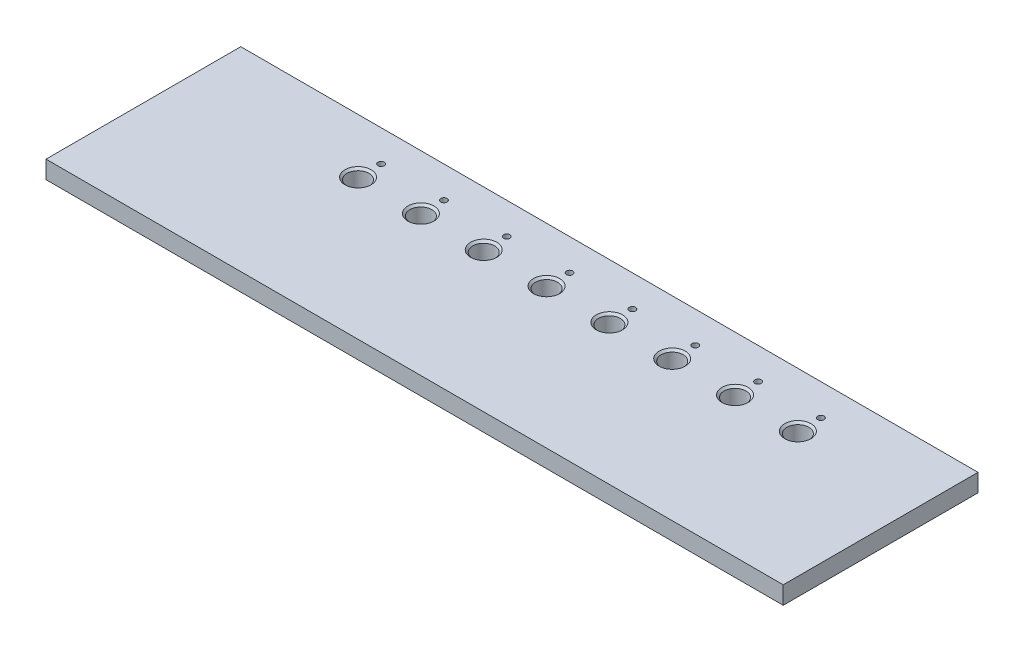
ISO-10303-21;
HEADER;
FILE_DESCRIPTION(('STEP AP214'),'2;1');
FILE_NAME('part.step','',(''),(''),'','','');
FILE_SCHEMA(('AUTOMOTIVE_DESIGN { 1 0 10303 214 1 1 1 1 }'));
ENDSEC;
DATA;
#1=APPLICATION_CONTEXT('core data for automotive mechanical design processes');
#2=APPLICATION_PROTOCOL_DEFINITION('international standard','automotive_design',2000,#1);
#3=PRODUCT_CONTEXT('',#1,'mechanical');
#4=PRODUCT('Part','Part','',(#3));
#5=PRODUCT_RELATED_PRODUCT_CATEGORY('part','',(#4));
#6=PRODUCT_DEFINITION_FORMATION('','',#4);
#7=PRODUCT_DEFINITION_CONTEXT('part definition',#1,'design');
#8=PRODUCT_DEFINITION('design','',#6,#7);
#9=PRODUCT_DEFINITION_SHAPE('','',#8);
#10=(LENGTH_UNIT() NAMED_UNIT(*) SI_UNIT(.MILLI.,.METRE.));
#11=(NAMED_UNIT(*) PLANE_ANGLE_UNIT() SI_UNIT($,.RADIAN.));
#12=(NAMED_UNIT(*) SI_UNIT($,.STERADIAN.) SOLID_ANGLE_UNIT());
#13=UNCERTAINTY_MEASURE_WITH_UNIT(LENGTH_MEASURE(1.E-05),#10,'distance_accuracy_value','');
#14=(GEOMETRIC_REPRESENTATION_CONTEXT(3) GLOBAL_UNCERTAINTY_ASSIGNED_CONTEXT((#13)) GLOBAL_UNIT_ASSIGNED_CONTEXT((#10,
#11,#12)) REPRESENTATION_CONTEXT('',''));
#15=CARTESIAN_POINT('',(0.,0.,0.));
#16=DIRECTION('',(0.,0.,1.));
#17=DIRECTION('',(1.,0.,0.));
#18=AXIS2_PLACEMENT_3D('',#15,#16,#17);
#19=CARTESIAN_POINT('',(181.,-8.5,0.));
#20=DIRECTION('',(1.,0.,0.));
#21=DIRECTION('',(0.,0.,-1.));
#22=AXIS2_PLACEMENT_3D('',#19,#20,#21);
#23=PLANE('',#22);
#24=DIRECTION('',(0.,0.,-1.));
#25=VECTOR('',#24,1.);
#26=CARTESIAN_POINT('',(181.,0.,0.));
#27=LINE('',#26,#25);
#28=CARTESIAN_POINT('',(181.,0.,93.));
#29=VERTEX_POINT('',#28);
#30=CARTESIAN_POINT('',(181.,0.,0.));
#31=VERTEX_POINT('',#30);
#32=EDGE_CURVE('E112',#29,#31,#27,.T.);
#33=ORIENTED_EDGE('',*,*,#32,.F.);
#34=DIRECTION('',(0.,1.,0.));
#35=VECTOR('',#34,1.);
#36=CARTESIAN_POINT('',(181.,-8.5,93.));
#37=LINE('',#36,#35);
#38=CARTESIAN_POINT('',(181.,-8.5,93.));
#39=VERTEX_POINT('',#38);
#40=EDGE_CURVE('E60',#39,#29,#37,.T.);
#41=ORIENTED_EDGE('',*,*,#40,.F.);
#42=DIRECTION('',(0.,0.,-1.));
#43=VECTOR('',#42,1.);
#44=CARTESIAN_POINT('',(181.,-8.5,0.));
#45=LINE('',#44,#43);
#46=CARTESIAN_POINT('',(181.,-8.5,0.));
#47=VERTEX_POINT('',#46);
#48=EDGE_CURVE('E105',#39,#47,#45,.T.);
#49=ORIENTED_EDGE('',*,*,#48,.T.);
#50=DIRECTION('',(0.,1.,0.));
#51=VECTOR('',#50,1.);
#52=CARTESIAN_POINT('',(181.,-8.5,0.));
#53=LINE('',#52,#51);
#54=EDGE_CURVE('E88',#47,#31,#53,.T.);
#55=ORIENTED_EDGE('',*,*,#54,.T.);
#56=EDGE_LOOP('',(#33,#41,#49,#55));
#57=FACE_BOUND('',#56,.T.);
#58=ADVANCED_FACE('F42',(#57),#23,.T.);
#59=CARTESIAN_POINT('',(181.,-8.5,93.));
#60=DIRECTION('',(0.,0.,1.));
#61=DIRECTION('',(1.,0.,0.));
#62=AXIS2_PLACEMENT_3D('',#59,#60,#61);
#63=PLANE('',#62);
#64=DIRECTION('',(1.,0.,0.));
#65=VECTOR('',#64,1.);
#66=CARTESIAN_POINT('',(181.,0.,93.));
#67=LINE('',#66,#65);
#68=CARTESIAN_POINT('',(-171.,0.,93.));
#69=VERTEX_POINT('',#68);
#70=EDGE_CURVE('E107',#69,#29,#67,.T.);
#71=ORIENTED_EDGE('',*,*,#70,.F.);
#72=DIRECTION('',(0.,1.,0.));
#73=VECTOR('',#72,1.);
#74=CARTESIAN_POINT('',(-171.,-8.5,93.));
#75=LINE('',#74,#73);
#76=CARTESIAN_POINT('',(-171.,-8.5,93.));
#77=VERTEX_POINT('',#76);
#78=EDGE_CURVE('E77',#77,#69,#75,.T.);
#79=ORIENTED_EDGE('',*,*,#78,.F.);
#80=DIRECTION('',(1.,0.,0.));
#81=VECTOR('',#80,1.);
#82=CARTESIAN_POINT('',(181.,-8.5,93.));
#83=LINE('',#82,#81);
#84=EDGE_CURVE('E102',#77,#39,#83,.T.);
#85=ORIENTED_EDGE('',*,*,#84,.T.);
#86=ORIENTED_EDGE('',*,*,#40,.T.);
#87=EDGE_LOOP('',(#71,#79,#85,#86));
#88=FACE_BOUND('',#87,.T.);
#89=ADVANCED_FACE('F186',(#88),#63,.T.);
#90=CARTESIAN_POINT('',(-171.,-8.5,0.));
#91=DIRECTION('',(-1.,0.,0.));
#92=DIRECTION('',(0.,0.,1.));
#93=AXIS2_PLACEMENT_3D('',#90,#91,#92);
#94=PLANE('',#93);
#95=DIRECTION('',(0.,0.,1.));
#96=VECTOR('',#95,1.);
#97=CARTESIAN_POINT('',(-171.,0.,0.));
#98=LINE('',#97,#96);
#99=CARTESIAN_POINT('',(-171.,0.,0.));
#100=VERTEX_POINT('',#99);
#101=EDGE_CURVE('E96',#100,#69,#98,.T.);
#102=ORIENTED_EDGE('',*,*,#101,.F.);
#103=DIRECTION('',(0.,1.,0.));
#104=VECTOR('',#103,1.);
#105=CARTESIAN_POINT('',(-171.,-8.5,0.));
#106=LINE('',#105,#104);
#107=CARTESIAN_POINT('',(-171.,-8.5,0.));
#108=VERTEX_POINT('',#107);
#109=EDGE_CURVE('E91',#108,#100,#106,.T.);
#110=ORIENTED_EDGE('',*,*,#109,.F.);
#111=DIRECTION('',(0.,0.,1.));
#112=VECTOR('',#111,1.);
#113=CARTESIAN_POINT('',(-171.,-8.5,0.));
#114=LINE('',#113,#112);
#115=EDGE_CURVE('E94',#108,#77,#114,.T.);
#116=ORIENTED_EDGE('',*,*,#115,.T.);
#117=ORIENTED_EDGE('',*,*,#78,.T.);
#118=EDGE_LOOP('',(#102,#110,#116,#117));
#119=FACE_BOUND('',#118,.T.);
#120=ADVANCED_FACE('F93',(#119),#94,.T.);
#121=CARTESIAN_POINT('',(181.,-8.5,0.));
#122=DIRECTION('',(0.,0.,-1.));
#123=DIRECTION('',(-1.,0.,0.));
#124=AXIS2_PLACEMENT_3D('',#121,#122,#123);
#125=PLANE('',#124);
#126=DIRECTION('',(-1.,0.,0.));
#127=VECTOR('',#126,1.);
#128=CARTESIAN_POINT('',(181.,0.,0.));
#129=LINE('',#128,#127);
#130=EDGE_CURVE('E115',#31,#100,#129,.T.);
#131=ORIENTED_EDGE('',*,*,#130,.F.);
#132=ORIENTED_EDGE('',*,*,#54,.F.);
#133=DIRECTION('',(-1.,0.,0.));
#134=VECTOR('',#133,1.);
#135=CARTESIAN_POINT('',(181.,-8.5,0.));
#136=LINE('',#135,#134);
#137=EDGE_CURVE('E101',#47,#108,#136,.T.);
#138=ORIENTED_EDGE('',*,*,#137,.T.);
#139=ORIENTED_EDGE('',*,*,#109,.T.);
#140=EDGE_LOOP('',(#131,#132,#138,#139));
#141=FACE_BOUND('',#140,.T.);
#142=ADVANCED_FACE('F104',(#141),#125,.T.);
#143=CARTESIAN_POINT('',(0.,-8.5,0.));
#144=DIRECTION('',(0.,-1.,0.));
#145=DIRECTION('',(0.,0.,-1.));
#146=AXIS2_PLACEMENT_3D('',#143,#144,#145);
#147=PLANE('',#146);
#148=CARTESIAN_POINT('',(-29.,-8.5,26.));
#149=DIRECTION('',(0.,1.,0.));
#150=DIRECTION('',(0.,0.,1.));
#151=AXIS2_PLACEMENT_3D('',#148,#149,#150);
#152=CIRCLE('',#151,5.24999999999994);
#153=CARTESIAN_POINT('',(-29.,-8.5,31.2499999999999));
#154=VERTEX_POINT('',#153);
#155=EDGE_CURVE('E268',#154,#154,#152,.T.);
#156=ORIENTED_EDGE('',*,*,#155,.T.);
#157=EDGE_LOOP('',(#156));
#158=FACE_BOUND('',#157,.T.);
#159=CARTESIAN_POINT('',(0.999999999999973,-8.5,15.));
#160=DIRECTION('',(0.,1.,0.));
#161=DIRECTION('',(0.,0.,1.));
#162=AXIS2_PLACEMENT_3D('',#159,#160,#161);
#163=CIRCLE('',#162,1.50000000000008);
#164=CARTESIAN_POINT('',(0.999999999999973,-8.5,16.5000000000001));
#165=VERTEX_POINT('',#164);
#166=EDGE_CURVE('E256',#165,#165,#163,.T.);
#167=ORIENTED_EDGE('',*,*,#166,.T.);
#168=EDGE_LOOP('',(#167));
#169=FACE_BOUND('',#168,.T.);
#170=CARTESIAN_POINT('',(0.999999999999973,-8.5,26.));
#171=DIRECTION('',(0.,1.,0.));
#172=DIRECTION('',(0.,0.,1.));
#173=AXIS2_PLACEMENT_3D('',#170,#171,#172);
#174=CIRCLE('',#173,5.24999999999993);
#175=CARTESIAN_POINT('',(0.999999999999973,-8.5,31.2499999999999));
#176=VERTEX_POINT('',#175);
#177=EDGE_CURVE('E250',#176,#176,#174,.T.);
#178=ORIENTED_EDGE('',*,*,#177,.T.);
#179=EDGE_LOOP('',(#178));
#180=FACE_BOUND('',#179,.T.);
#181=CARTESIAN_POINT('',(31.,-8.5,15.));
#182=DIRECTION('',(0.,1.,0.));
#183=DIRECTION('',(0.,0.,1.));
#184=AXIS2_PLACEMENT_3D('',#181,#182,#183);
#185=CIRCLE('',#184,1.50000000000008);
#186=CARTESIAN_POINT('',(31.,-8.5,16.5000000000001));
#187=VERTEX_POINT('',#186);
#188=EDGE_CURVE('E253',#187,#187,#185,.T.);
#189=ORIENTED_EDGE('',*,*,#188,.T.);
#190=EDGE_LOOP('',(#189));
#191=FACE_BOUND('',#190,.T.);
#192=CARTESIAN_POINT('',(-89.,-8.5,26.));
#193=DIRECTION('',(0.,1.,0.));
#194=DIRECTION('',(0.,0.,1.));
#195=AXIS2_PLACEMENT_3D('',#192,#193,#194);
#196=CIRCLE('',#195,5.24999999999993);
#197=CARTESIAN_POINT('',(-89.,-8.5,31.2499999999999));
#198=VERTEX_POINT('',#197);
#199=EDGE_CURVE('E283',#198,#198,#196,.T.);
#200=ORIENTED_EDGE('',*,*,#199,.T.);
#201=EDGE_LOOP('',(#200));
#202=FACE_BOUND('',#201,.T.);
#203=CARTESIAN_POINT('',(-59.,-8.5,15.));
#204=DIRECTION('',(0.,1.,0.));
#205=DIRECTION('',(0.,0.,1.));
#206=AXIS2_PLACEMENT_3D('',#203,#204,#205);
#207=CIRCLE('',#206,1.50000000000007);
#208=CARTESIAN_POINT('',(-59.,-8.5,16.5000000000001));
#209=VERTEX_POINT('',#208);
#210=EDGE_CURVE('E287',#209,#209,#207,.T.);
#211=ORIENTED_EDGE('',*,*,#210,.T.);
#212=EDGE_LOOP('',(#211));
#213=FACE_BOUND('',#212,.T.);
#214=CARTESIAN_POINT('',(-59.,-8.5,26.));
#215=DIRECTION('',(0.,1.,0.));
#216=DIRECTION('',(0.,0.,1.));
#217=AXIS2_PLACEMENT_3D('',#214,#215,#216);
#218=CIRCLE('',#217,5.24999999999993);
#219=CARTESIAN_POINT('',(-59.,-8.5,31.2499999999999));
#220=VERTEX_POINT('',#219);
#221=EDGE_CURVE('E274',#220,#220,#218,.T.);
#222=ORIENTED_EDGE('',*,*,#221,.T.);
#223=EDGE_LOOP('',(#222));
#224=FACE_BOUND('',#223,.T.);
#225=CARTESIAN_POINT('',(-29.,-8.5,15.));
#226=DIRECTION('',(0.,1.,0.));
#227=DIRECTION('',(0.,0.,1.));
#228=AXIS2_PLACEMENT_3D('',#225,#226,#227);
#229=CIRCLE('',#228,1.50000000000008);
#230=CARTESIAN_POINT('',(-29.,-8.5,16.5000000000001));
#231=VERTEX_POINT('',#230);
#232=EDGE_CURVE('E278',#231,#231,#229,.T.);
#233=ORIENTED_EDGE('',*,*,#232,.T.);
#234=EDGE_LOOP('',(#233));
#235=FACE_BOUND('',#234,.T.);
#236=CARTESIAN_POINT('',(91.,-8.5,26.));
#237=DIRECTION('',(0.,1.,0.));
#238=DIRECTION('',(0.,0.,1.));
#239=AXIS2_PLACEMENT_3D('',#236,#237,#238);
#240=CIRCLE('',#239,5.24999999999993);
#241=CARTESIAN_POINT('',(91.,-8.5,31.2499999999999));
#242=VERTEX_POINT('',#241);
#243=EDGE_CURVE('E540',#242,#242,#240,.T.);
#244=ORIENTED_EDGE('',*,*,#243,.T.);
#245=EDGE_LOOP('',(#244));
#246=FACE_BOUND('',#245,.T.);
#247=CARTESIAN_POINT('',(121.,-8.5,15.));
#248=DIRECTION('',(0.,1.,0.));
#249=DIRECTION('',(0.,0.,1.));
#250=AXIS2_PLACEMENT_3D('',#247,#248,#249);
#251=CIRCLE('',#250,1.50000000000007);
#252=CARTESIAN_POINT('',(121.,-8.5,16.5000000000001));
#253=VERTEX_POINT('',#252);
#254=EDGE_CURVE('E544',#253,#253,#251,.T.);
#255=ORIENTED_EDGE('',*,*,#254,.T.);
#256=EDGE_LOOP('',(#255));
#257=FACE_BOUND('',#256,.T.);
#258=CARTESIAN_POINT('',(121.,-8.5,26.));
#259=DIRECTION('',(0.,1.,0.));
#260=DIRECTION('',(0.,0.,1.));
#261=AXIS2_PLACEMENT_3D('',#258,#259,#260);
#262=CIRCLE('',#261,5.24999999999992);
#263=CARTESIAN_POINT('',(121.,-8.5,31.2499999999999));
#264=VERTEX_POINT('',#263);
#265=EDGE_CURVE('E548',#264,#264,#262,.T.);
#266=ORIENTED_EDGE('',*,*,#265,.T.);
#267=EDGE_LOOP('',(#266));
#268=FACE_BOUND('',#267,.T.);
#269=CARTESIAN_POINT('',(31.,-8.5,26.));
#270=DIRECTION('',(0.,1.,0.));
#271=DIRECTION('',(0.,0.,1.));
#272=AXIS2_PLACEMENT_3D('',#269,#270,#271);
#273=CIRCLE('',#272,5.24999999999994);
#274=CARTESIAN_POINT('',(31.,-8.5,31.2499999999999));
#275=VERTEX_POINT('',#274);
#276=EDGE_CURVE('E267',#275,#275,#273,.T.);
#277=ORIENTED_EDGE('',*,*,#276,.T.);
#278=EDGE_LOOP('',(#277));
#279=FACE_BOUND('',#278,.T.);
#280=CARTESIAN_POINT('',(61.,-8.5,15.));
#281=DIRECTION('',(0.,1.,0.));
#282=DIRECTION('',(0.,0.,1.));
#283=AXIS2_PLACEMENT_3D('',#280,#281,#282);
#284=CIRCLE('',#283,1.50000000000007);
#285=CARTESIAN_POINT('',(61.,-8.5,16.5000000000001));
#286=VERTEX_POINT('',#285);
#287=EDGE_CURVE('E555',#286,#286,#284,.T.);
#288=ORIENTED_EDGE('',*,*,#287,.T.);
#289=EDGE_LOOP('',(#288));
#290=FACE_BOUND('',#289,.T.);
#291=CARTESIAN_POINT('',(61.,-8.5,26.));
#292=DIRECTION('',(0.,1.,0.));
#293=DIRECTION('',(0.,0.,1.));
#294=AXIS2_PLACEMENT_3D('',#291,#292,#293);
#295=CIRCLE('',#294,5.24999999999993);
#296=CARTESIAN_POINT('',(61.,-8.5,31.2499999999999));
#297=VERTEX_POINT('',#296);
#298=EDGE_CURVE('E559',#297,#297,#295,.T.);
#299=ORIENTED_EDGE('',*,*,#298,.T.);
#300=EDGE_LOOP('',(#299));
#301=FACE_BOUND('',#300,.T.);
#302=CARTESIAN_POINT('',(91.,-8.5,15.));
#303=DIRECTION('',(0.,1.,0.));
#304=DIRECTION('',(0.,0.,1.));
#305=AXIS2_PLACEMENT_3D('',#302,#303,#304);
#306=CIRCLE('',#305,1.50000000000007);
#307=CARTESIAN_POINT('',(91.,-8.5,16.5000000000001));
#308=VERTEX_POINT('',#307);
#309=EDGE_CURVE('E563',#308,#308,#306,.T.);
#310=ORIENTED_EDGE('',*,*,#309,.T.);
#311=EDGE_LOOP('',(#310));
#312=FACE_BOUND('',#311,.T.);
#313=CARTESIAN_POINT('',(-89.,-8.5,15.));
#314=DIRECTION('',(0.,1.,0.));
#315=DIRECTION('',(0.,0.,1.));
#316=AXIS2_PLACEMENT_3D('',#313,#314,#315);
#317=CIRCLE('',#316,1.50000000000007);
#318=CARTESIAN_POINT('',(-89.,-8.5,16.5000000000001));
#319=VERTEX_POINT('',#318);
#320=EDGE_CURVE('E116',#319,#319,#317,.T.);
#321=ORIENTED_EDGE('',*,*,#320,.T.);
#322=EDGE_LOOP('',(#321));
#323=FACE_BOUND('',#322,.T.);
#324=ORIENTED_EDGE('',*,*,#48,.F.);
#325=ORIENTED_EDGE('',*,*,#84,.F.);
#326=ORIENTED_EDGE('',*,*,#115,.F.);
#327=ORIENTED_EDGE('',*,*,#137,.F.);
#328=EDGE_LOOP('',(#324,#325,#326,#327));
#329=FACE_BOUND('',#328,.T.);
#330=ADVANCED_FACE('F100',(#158,#169,#180,#191,#202,#213,#224,#235,#246,#257,#268,#279,#290,
#301,#312,#323,#329),#147,.T.);
#331=CARTESIAN_POINT('',(0.,0.,0.));
#332=DIRECTION('',(0.,-1.,0.));
#333=DIRECTION('',(0.,0.,-1.));
#334=AXIS2_PLACEMENT_3D('',#331,#332,#333);
#335=PLANE('',#334);
#336=CARTESIAN_POINT('',(121.,0.,26.));
#337=DIRECTION('',(0.,-1.,0.));
#338=DIRECTION('',(0.,0.,-1.));
#339=AXIS2_PLACEMENT_3D('',#336,#337,#338);
#340=CIRCLE('',#339,6.24999999999992);
#341=CARTESIAN_POINT('',(121.,0.,19.7500000000001));
#342=VERTEX_POINT('',#341);
#343=EDGE_CURVE('E148',#342,#342,#340,.T.);
#344=ORIENTED_EDGE('',*,*,#343,.T.);
#345=EDGE_LOOP('',(#344));
#346=FACE_BOUND('',#345,.T.);
#347=CARTESIAN_POINT('',(91.,0.,26.));
#348=DIRECTION('',(0.,-1.,0.));
#349=DIRECTION('',(0.,0.,-1.));
#350=AXIS2_PLACEMENT_3D('',#347,#348,#349);
#351=CIRCLE('',#350,6.24999999999993);
#352=CARTESIAN_POINT('',(91.,0.,19.7500000000001));
#353=VERTEX_POINT('',#352);
#354=EDGE_CURVE('E145',#353,#353,#351,.T.);
#355=ORIENTED_EDGE('',*,*,#354,.T.);
#356=EDGE_LOOP('',(#355));
#357=FACE_BOUND('',#356,.T.);
#358=CARTESIAN_POINT('',(61.,0.,26.));
#359=DIRECTION('',(0.,-1.,0.));
#360=DIRECTION('',(0.,0.,-1.));
#361=AXIS2_PLACEMENT_3D('',#358,#359,#360);
#362=CIRCLE('',#361,6.24999999999993);
#363=CARTESIAN_POINT('',(61.,0.,19.7500000000001));
#364=VERTEX_POINT('',#363);
#365=EDGE_CURVE('E142',#364,#364,#362,.T.);
#366=ORIENTED_EDGE('',*,*,#365,.T.);
#367=EDGE_LOOP('',(#366));
#368=FACE_BOUND('',#367,.T.);
#369=CARTESIAN_POINT('',(31.,0.,26.));
#370=DIRECTION('',(0.,-1.,0.));
#371=DIRECTION('',(0.,0.,-1.));
#372=AXIS2_PLACEMENT_3D('',#369,#370,#371);
#373=CIRCLE('',#372,6.24999999999992);
#374=CARTESIAN_POINT('',(31.,0.,19.7500000000001));
#375=VERTEX_POINT('',#374);
#376=EDGE_CURVE('E139',#375,#375,#373,.T.);
#377=ORIENTED_EDGE('',*,*,#376,.T.);
#378=EDGE_LOOP('',(#377));
#379=FACE_BOUND('',#378,.T.);
#380=CARTESIAN_POINT('',(0.999999999999973,0.,26.));
#381=DIRECTION('',(0.,-1.,0.));
#382=DIRECTION('',(0.,0.,-1.));
#383=AXIS2_PLACEMENT_3D('',#380,#381,#382);
#384=CIRCLE('',#383,6.24999999999993);
#385=CARTESIAN_POINT('',(0.999999999999973,0.,19.7500000000001));
#386=VERTEX_POINT('',#385);
#387=EDGE_CURVE('E136',#386,#386,#384,.T.);
#388=ORIENTED_EDGE('',*,*,#387,.T.);
#389=EDGE_LOOP('',(#388));
#390=FACE_BOUND('',#389,.T.);
#391=CARTESIAN_POINT('',(-29.,0.,26.));
#392=DIRECTION('',(0.,-1.,0.));
#393=DIRECTION('',(0.,0.,-1.));
#394=AXIS2_PLACEMENT_3D('',#391,#392,#393);
#395=CIRCLE('',#394,6.24999999999993);
#396=CARTESIAN_POINT('',(-29.,0.,19.7500000000001));
#397=VERTEX_POINT('',#396);
#398=EDGE_CURVE('E133',#397,#397,#395,.T.);
#399=ORIENTED_EDGE('',*,*,#398,.T.);
#400=EDGE_LOOP('',(#399));
#401=FACE_BOUND('',#400,.T.);
#402=CARTESIAN_POINT('',(-59.,0.,26.));
#403=DIRECTION('',(0.,-1.,0.));
#404=DIRECTION('',(0.,0.,-1.));
#405=AXIS2_PLACEMENT_3D('',#402,#403,#404);
#406=CIRCLE('',#405,6.24999999999993);
#407=CARTESIAN_POINT('',(-59.,0.,19.7500000000001));
#408=VERTEX_POINT('',#407);
#409=EDGE_CURVE('E130',#408,#408,#406,.T.);
#410=ORIENTED_EDGE('',*,*,#409,.T.);
#411=EDGE_LOOP('',(#410));
#412=FACE_BOUND('',#411,.T.);
#413=CARTESIAN_POINT('',(-89.,0.,26.));
#414=DIRECTION('',(0.,-1.,0.));
#415=DIRECTION('',(0.,0.,-1.));
#416=AXIS2_PLACEMENT_3D('',#413,#414,#415);
#417=CIRCLE('',#416,6.24999999999993);
#418=CARTESIAN_POINT('',(-89.,0.,19.7500000000001));
#419=VERTEX_POINT('',#418);
#420=EDGE_CURVE('E127',#419,#419,#417,.T.);
#421=ORIENTED_EDGE('',*,*,#420,.T.);
#422=EDGE_LOOP('',(#421));
#423=FACE_BOUND('',#422,.T.);
#424=CARTESIAN_POINT('',(0.999999999999973,0.,15.));
#425=DIRECTION('',(0.,1.,0.));
#426=DIRECTION('',(0.,0.,1.));
#427=AXIS2_PLACEMENT_3D('',#424,#425,#426);
#428=CIRCLE('',#427,1.50000000000008);
#429=CARTESIAN_POINT('',(0.999999999999973,0.,16.5000000000001));
#430=VERTEX_POINT('',#429);
#431=EDGE_CURVE('E252',#430,#430,#428,.T.);
#432=ORIENTED_EDGE('',*,*,#431,.F.);
#433=EDGE_LOOP('',(#432));
#434=FACE_BOUND('',#433,.T.);
#435=CARTESIAN_POINT('',(31.,0.,15.));
#436=DIRECTION('',(0.,1.,0.));
#437=DIRECTION('',(0.,0.,1.));
#438=AXIS2_PLACEMENT_3D('',#435,#436,#437);
#439=CIRCLE('',#438,1.50000000000008);
#440=CARTESIAN_POINT('',(31.,0.,16.5000000000001));
#441=VERTEX_POINT('',#440);
#442=EDGE_CURVE('E259',#441,#441,#439,.T.);
#443=ORIENTED_EDGE('',*,*,#442,.F.);
#444=EDGE_LOOP('',(#443));
#445=FACE_BOUND('',#444,.T.);
#446=CARTESIAN_POINT('',(-59.,0.,15.));
#447=DIRECTION('',(0.,1.,0.));
#448=DIRECTION('',(0.,0.,1.));
#449=AXIS2_PLACEMENT_3D('',#446,#447,#448);
#450=CIRCLE('',#449,1.50000000000007);
#451=CARTESIAN_POINT('',(-59.,0.,16.5000000000001));
#452=VERTEX_POINT('',#451);
#453=EDGE_CURVE('E277',#452,#452,#450,.T.);
#454=ORIENTED_EDGE('',*,*,#453,.F.);
#455=EDGE_LOOP('',(#454));
#456=FACE_BOUND('',#455,.T.);
#457=CARTESIAN_POINT('',(-29.,0.,15.));
#458=DIRECTION('',(0.,1.,0.));
#459=DIRECTION('',(0.,0.,1.));
#460=AXIS2_PLACEMENT_3D('',#457,#458,#459);
#461=CIRCLE('',#460,1.50000000000008);
#462=CARTESIAN_POINT('',(-29.,0.,16.5000000000001));
#463=VERTEX_POINT('',#462);
#464=EDGE_CURVE('E271',#463,#463,#461,.T.);
#465=ORIENTED_EDGE('',*,*,#464,.F.);
#466=EDGE_LOOP('',(#465));
#467=FACE_BOUND('',#466,.T.);
#468=CARTESIAN_POINT('',(121.,0.,15.));
#469=DIRECTION('',(0.,1.,0.));
#470=DIRECTION('',(0.,0.,1.));
#471=AXIS2_PLACEMENT_3D('',#468,#469,#470);
#472=CIRCLE('',#471,1.50000000000007);
#473=CARTESIAN_POINT('',(121.,0.,16.5000000000001));
#474=VERTEX_POINT('',#473);
#475=EDGE_CURVE('E579',#474,#474,#472,.T.);
#476=ORIENTED_EDGE('',*,*,#475,.F.);
#477=EDGE_LOOP('',(#476));
#478=FACE_BOUND('',#477,.T.);
#479=CARTESIAN_POINT('',(61.,0.,15.));
#480=DIRECTION('',(0.,1.,0.));
#481=DIRECTION('',(0.,0.,1.));
#482=AXIS2_PLACEMENT_3D('',#479,#480,#481);
#483=CIRCLE('',#482,1.50000000000007);
#484=CARTESIAN_POINT('',(61.,0.,16.5000000000001));
#485=VERTEX_POINT('',#484);
#486=EDGE_CURVE('E262',#485,#485,#483,.T.);
#487=ORIENTED_EDGE('',*,*,#486,.F.);
#488=EDGE_LOOP('',(#487));
#489=FACE_BOUND('',#488,.T.);
#490=CARTESIAN_POINT('',(91.,0.,15.));
#491=DIRECTION('',(0.,1.,0.));
#492=DIRECTION('',(0.,0.,1.));
#493=AXIS2_PLACEMENT_3D('',#490,#491,#492);
#494=CIRCLE('',#493,1.50000000000007);
#495=CARTESIAN_POINT('',(91.,0.,16.5000000000001));
#496=VERTEX_POINT('',#495);
#497=EDGE_CURVE('E565',#496,#496,#494,.T.);
#498=ORIENTED_EDGE('',*,*,#497,.F.);
#499=EDGE_LOOP('',(#498));
#500=FACE_BOUND('',#499,.T.);
#501=CARTESIAN_POINT('',(-89.,0.,15.));
#502=DIRECTION('',(0.,1.,0.));
#503=DIRECTION('',(0.,0.,1.));
#504=AXIS2_PLACEMENT_3D('',#501,#502,#503);
#505=CIRCLE('',#504,1.50000000000007);
#506=CARTESIAN_POINT('',(-89.,0.,16.5000000000001));
#507=VERTEX_POINT('',#506);
#508=EDGE_CURVE('E286',#507,#507,#505,.T.);
#509=ORIENTED_EDGE('',*,*,#508,.F.);
#510=EDGE_LOOP('',(#509));
#511=FACE_BOUND('',#510,.T.);
#512=ORIENTED_EDGE('',*,*,#32,.T.);
#513=ORIENTED_EDGE('',*,*,#130,.T.);
#514=ORIENTED_EDGE('',*,*,#101,.T.);
#515=ORIENTED_EDGE('',*,*,#70,.T.);
#516=EDGE_LOOP('',(#512,#513,#514,#515));
#517=FACE_BOUND('',#516,.T.);
#518=ADVANCED_FACE('F298',(#346,#357,#368,#379,#390,#401,#412,#423,#434,#445,#456,#467,#478,
#489,#500,#511,#517),#335,.F.);
#519=CARTESIAN_POINT('',(-89.,-8.5,15.));
#520=DIRECTION('',(0.,1.,0.));
#521=DIRECTION('',(0.,0.,1.));
#522=AXIS2_PLACEMENT_3D('',#519,#520,#521);
#523=CYLINDRICAL_SURFACE('',#522,1.50000000000007);
#524=ORIENTED_EDGE('',*,*,#320,.F.);
#525=EDGE_LOOP('',(#524));
#526=FACE_BOUND('',#525,.T.);
#527=ORIENTED_EDGE('',*,*,#508,.T.);
#528=EDGE_LOOP('',(#527));
#529=FACE_BOUND('',#528,.T.);
#530=ADVANCED_FACE('F296',(#526,#529),#523,.F.);
#531=CARTESIAN_POINT('',(91.,-8.5,15.));
#532=DIRECTION('',(0.,1.,0.));
#533=DIRECTION('',(0.,0.,1.));
#534=AXIS2_PLACEMENT_3D('',#531,#532,#533);
#535=CYLINDRICAL_SURFACE('',#534,1.50000000000007);
#536=ORIENTED_EDGE('',*,*,#309,.F.);
#537=EDGE_LOOP('',(#536));
#538=FACE_BOUND('',#537,.T.);
#539=ORIENTED_EDGE('',*,*,#497,.T.);
#540=EDGE_LOOP('',(#539));
#541=FACE_BOUND('',#540,.T.);
#542=ADVANCED_FACE('F307',(#538,#541),#535,.F.);
#543=CARTESIAN_POINT('',(61.,-8.5,26.));
#544=DIRECTION('',(0.,1.,0.));
#545=DIRECTION('',(0.,0.,1.));
#546=AXIS2_PLACEMENT_3D('',#543,#544,#545);
#547=CYLINDRICAL_SURFACE('',#546,5.24999999999993);
#548=CARTESIAN_POINT('',(61.,-1.00000000000001,26.));
#549=DIRECTION('',(0.,-1.,0.));
#550=DIRECTION('',(0.,0.,-1.));
#551=AXIS2_PLACEMENT_3D('',#548,#549,#550);
#552=CIRCLE('',#551,5.24999999999993);
#553=CARTESIAN_POINT('',(61.,-1.00000000000001,20.7500000000001));
#554=VERTEX_POINT('',#553);
#555=EDGE_CURVE('E154',#554,#554,#552,.F.);
#556=ORIENTED_EDGE('',*,*,#555,.T.);
#557=EDGE_LOOP('',(#556));
#558=FACE_BOUND('',#557,.T.);
#559=ORIENTED_EDGE('',*,*,#298,.F.);
#560=EDGE_LOOP('',(#559));
#561=FACE_BOUND('',#560,.T.);
#562=ADVANCED_FACE('F339',(#558,#561),#547,.F.);
#563=CARTESIAN_POINT('',(61.,-8.5,15.));
#564=DIRECTION('',(0.,1.,0.));
#565=DIRECTION('',(0.,0.,1.));
#566=AXIS2_PLACEMENT_3D('',#563,#564,#565);
#567=CYLINDRICAL_SURFACE('',#566,1.50000000000007);
#568=ORIENTED_EDGE('',*,*,#287,.F.);
#569=EDGE_LOOP('',(#568));
#570=FACE_BOUND('',#569,.T.);
#571=ORIENTED_EDGE('',*,*,#486,.T.);
#572=EDGE_LOOP('',(#571));
#573=FACE_BOUND('',#572,.T.);
#574=ADVANCED_FACE('F347',(#570,#573),#567,.F.);
#575=CARTESIAN_POINT('',(31.,-8.5,26.));
#576=DIRECTION('',(0.,1.,0.));
#577=DIRECTION('',(0.,0.,1.));
#578=AXIS2_PLACEMENT_3D('',#575,#576,#577);
#579=CYLINDRICAL_SURFACE('',#578,5.24999999999994);
#580=CARTESIAN_POINT('',(31.,-1.,26.));
#581=DIRECTION('',(0.,-1.,0.));
#582=DIRECTION('',(0.,0.,-1.));
#583=AXIS2_PLACEMENT_3D('',#580,#581,#582);
#584=CIRCLE('',#583,5.24999999999994);
#585=CARTESIAN_POINT('',(31.,-1.,20.7500000000001));
#586=VERTEX_POINT('',#585);
#587=EDGE_CURVE('E157',#586,#586,#584,.F.);
#588=ORIENTED_EDGE('',*,*,#587,.T.);
#589=EDGE_LOOP('',(#588));
#590=FACE_BOUND('',#589,.T.);
#591=ORIENTED_EDGE('',*,*,#276,.F.);
#592=EDGE_LOOP('',(#591));
#593=FACE_BOUND('',#592,.T.);
#594=ADVANCED_FACE('F352',(#590,#593),#579,.F.);
#595=CARTESIAN_POINT('',(121.,-8.5,26.));
#596=DIRECTION('',(0.,1.,0.));
#597=DIRECTION('',(0.,0.,1.));
#598=AXIS2_PLACEMENT_3D('',#595,#596,#597);
#599=CYLINDRICAL_SURFACE('',#598,5.24999999999992);
#600=CARTESIAN_POINT('',(121.,-1.00000000000002,26.));
#601=DIRECTION('',(0.,-1.,0.));
#602=DIRECTION('',(0.,0.,-1.));
#603=AXIS2_PLACEMENT_3D('',#600,#601,#602);
#604=CIRCLE('',#603,5.24999999999992);
#605=CARTESIAN_POINT('',(121.,-1.00000000000002,20.7500000000001));
#606=VERTEX_POINT('',#605);
#607=EDGE_CURVE('E122',#606,#606,#604,.F.);
#608=ORIENTED_EDGE('',*,*,#607,.T.);
#609=EDGE_LOOP('',(#608));
#610=FACE_BOUND('',#609,.T.);
#611=ORIENTED_EDGE('',*,*,#265,.F.);
#612=EDGE_LOOP('',(#611));
#613=FACE_BOUND('',#612,.T.);
#614=ADVANCED_FACE('F366',(#610,#613),#599,.F.);
#615=CARTESIAN_POINT('',(121.,-8.5,15.));
#616=DIRECTION('',(0.,1.,0.));
#617=DIRECTION('',(0.,0.,1.));
#618=AXIS2_PLACEMENT_3D('',#615,#616,#617);
#619=CYLINDRICAL_SURFACE('',#618,1.50000000000007);
#620=ORIENTED_EDGE('',*,*,#254,.F.);
#621=EDGE_LOOP('',(#620));
#622=FACE_BOUND('',#621,.T.);
#623=ORIENTED_EDGE('',*,*,#475,.T.);
#624=EDGE_LOOP('',(#623));
#625=FACE_BOUND('',#624,.T.);
#626=ADVANCED_FACE('F360',(#622,#625),#619,.F.);
#627=CARTESIAN_POINT('',(91.,-8.5,26.));
#628=DIRECTION('',(0.,1.,0.));
#629=DIRECTION('',(0.,0.,1.));
#630=AXIS2_PLACEMENT_3D('',#627,#628,#629);
#631=CYLINDRICAL_SURFACE('',#630,5.24999999999993);
#632=CARTESIAN_POINT('',(91.,-1.00000000000001,26.));
#633=DIRECTION('',(0.,-1.,0.));
#634=DIRECTION('',(0.,0.,-1.));
#635=AXIS2_PLACEMENT_3D('',#632,#633,#634);
#636=CIRCLE('',#635,5.24999999999993);
#637=CARTESIAN_POINT('',(91.,-1.00000000000001,20.7500000000001));
#638=VERTEX_POINT('',#637);
#639=EDGE_CURVE('E151',#638,#638,#636,.F.);
#640=ORIENTED_EDGE('',*,*,#639,.T.);
#641=EDGE_LOOP('',(#640));
#642=FACE_BOUND('',#641,.T.);
#643=ORIENTED_EDGE('',*,*,#243,.F.);
#644=EDGE_LOOP('',(#643));
#645=FACE_BOUND('',#644,.T.);
#646=ADVANCED_FACE('F365',(#642,#645),#631,.F.);
#647=CARTESIAN_POINT('',(-29.,-8.5,15.));
#648=DIRECTION('',(0.,1.,0.));
#649=DIRECTION('',(0.,0.,1.));
#650=AXIS2_PLACEMENT_3D('',#647,#648,#649);
#651=CYLINDRICAL_SURFACE('',#650,1.50000000000008);
#652=ORIENTED_EDGE('',*,*,#232,.F.);
#653=EDGE_LOOP('',(#652));
#654=FACE_BOUND('',#653,.T.);
#655=ORIENTED_EDGE('',*,*,#464,.T.);
#656=EDGE_LOOP('',(#655));
#657=FACE_BOUND('',#656,.T.);
#658=ADVANCED_FACE('F376',(#654,#657),#651,.F.);
#659=CARTESIAN_POINT('',(-59.,-8.5,26.));
#660=DIRECTION('',(0.,1.,0.));
#661=DIRECTION('',(0.,0.,1.));
#662=AXIS2_PLACEMENT_3D('',#659,#660,#661);
#663=CYLINDRICAL_SURFACE('',#662,5.24999999999993);
#664=CARTESIAN_POINT('',(-59.,-1.00000000000001,26.));
#665=DIRECTION('',(0.,-1.,0.));
#666=DIRECTION('',(0.,0.,-1.));
#667=AXIS2_PLACEMENT_3D('',#664,#665,#666);
#668=CIRCLE('',#667,5.24999999999993);
#669=CARTESIAN_POINT('',(-59.,-1.00000000000001,20.7500000000001));
#670=VERTEX_POINT('',#669);
#671=EDGE_CURVE('E52',#670,#670,#668,.F.);
#672=ORIENTED_EDGE('',*,*,#671,.T.);
#673=EDGE_LOOP('',(#672));
#674=FACE_BOUND('',#673,.T.);
#675=ORIENTED_EDGE('',*,*,#221,.F.);
#676=EDGE_LOOP('',(#675));
#677=FACE_BOUND('',#676,.T.);
#678=ADVANCED_FACE('F168',(#674,#677),#663,.F.);
#679=CARTESIAN_POINT('',(-59.,-8.5,15.));
#680=DIRECTION('',(0.,1.,0.));
#681=DIRECTION('',(0.,0.,1.));
#682=AXIS2_PLACEMENT_3D('',#679,#680,#681);
#683=CYLINDRICAL_SURFACE('',#682,1.50000000000007);
#684=ORIENTED_EDGE('',*,*,#210,.F.);
#685=EDGE_LOOP('',(#684));
#686=FACE_BOUND('',#685,.T.);
#687=ORIENTED_EDGE('',*,*,#453,.T.);
#688=EDGE_LOOP('',(#687));
#689=FACE_BOUND('',#688,.T.);
#690=ADVANCED_FACE('F388',(#686,#689),#683,.F.);
#691=CARTESIAN_POINT('',(-89.,-8.5,26.));
#692=DIRECTION('',(0.,1.,0.));
#693=DIRECTION('',(0.,0.,1.));
#694=AXIS2_PLACEMENT_3D('',#691,#692,#693);
#695=CYLINDRICAL_SURFACE('',#694,5.24999999999993);
#696=CARTESIAN_POINT('',(-89.,-1.00000000000001,26.));
#697=DIRECTION('',(0.,-1.,0.));
#698=DIRECTION('',(0.,0.,-1.));
#699=AXIS2_PLACEMENT_3D('',#696,#697,#698);
#700=CIRCLE('',#699,5.24999999999993);
#701=CARTESIAN_POINT('',(-89.,-1.00000000000001,20.7500000000001));
#702=VERTEX_POINT('',#701);
#703=EDGE_CURVE('E12',#702,#702,#700,.F.);
#704=ORIENTED_EDGE('',*,*,#703,.T.);
#705=EDGE_LOOP('',(#704));
#706=FACE_BOUND('',#705,.T.);
#707=ORIENTED_EDGE('',*,*,#199,.F.);
#708=EDGE_LOOP('',(#707));
#709=FACE_BOUND('',#708,.T.);
#710=ADVANCED_FACE('F393',(#706,#709),#695,.F.);
#711=CARTESIAN_POINT('',(31.,-8.5,15.));
#712=DIRECTION('',(0.,1.,0.));
#713=DIRECTION('',(0.,0.,1.));
#714=AXIS2_PLACEMENT_3D('',#711,#712,#713);
#715=CYLINDRICAL_SURFACE('',#714,1.50000000000008);
#716=ORIENTED_EDGE('',*,*,#188,.F.);
#717=EDGE_LOOP('',(#716));
#718=FACE_BOUND('',#717,.T.);
#719=ORIENTED_EDGE('',*,*,#442,.T.);
#720=EDGE_LOOP('',(#719));
#721=FACE_BOUND('',#720,.T.);
#722=ADVANCED_FACE('F246',(#718,#721),#715,.F.);
#723=CARTESIAN_POINT('',(0.999999999999973,-8.5,26.));
#724=DIRECTION('',(0.,1.,0.));
#725=DIRECTION('',(0.,0.,1.));
#726=AXIS2_PLACEMENT_3D('',#723,#724,#725);
#727=CYLINDRICAL_SURFACE('',#726,5.24999999999993);
#728=CARTESIAN_POINT('',(0.999999999999973,-1.00000000000001,26.));
#729=DIRECTION('',(0.,-1.,0.));
#730=DIRECTION('',(0.,0.,-1.));
#731=AXIS2_PLACEMENT_3D('',#728,#729,#730);
#732=CIRCLE('',#731,5.24999999999993);
#733=CARTESIAN_POINT('',(0.999999999999973,-1.00000000000001,20.7500000000001));
#734=VERTEX_POINT('',#733);
#735=EDGE_CURVE('E160',#734,#734,#732,.F.);
#736=ORIENTED_EDGE('',*,*,#735,.T.);
#737=EDGE_LOOP('',(#736));
#738=FACE_BOUND('',#737,.T.);
#739=ORIENTED_EDGE('',*,*,#177,.F.);
#740=EDGE_LOOP('',(#739));
#741=FACE_BOUND('',#740,.T.);
#742=ADVANCED_FACE('F242',(#738,#741),#727,.F.);
#743=CARTESIAN_POINT('',(0.999999999999973,-8.5,15.));
#744=DIRECTION('',(0.,1.,0.));
#745=DIRECTION('',(0.,0.,1.));
#746=AXIS2_PLACEMENT_3D('',#743,#744,#745);
#747=CYLINDRICAL_SURFACE('',#746,1.50000000000008);
#748=ORIENTED_EDGE('',*,*,#166,.F.);
#749=EDGE_LOOP('',(#748));
#750=FACE_BOUND('',#749,.T.);
#751=ORIENTED_EDGE('',*,*,#431,.T.);
#752=EDGE_LOOP('',(#751));
#753=FACE_BOUND('',#752,.T.);
#754=ADVANCED_FACE('F245',(#750,#753),#747,.F.);
#755=CARTESIAN_POINT('',(-29.,-8.5,26.));
#756=DIRECTION('',(0.,1.,0.));
#757=DIRECTION('',(0.,0.,1.));
#758=AXIS2_PLACEMENT_3D('',#755,#756,#757);
#759=CYLINDRICAL_SURFACE('',#758,5.24999999999994);
#760=CARTESIAN_POINT('',(-29.,-1.,26.));
#761=DIRECTION('',(0.,-1.,0.));
#762=DIRECTION('',(0.,0.,-1.));
#763=AXIS2_PLACEMENT_3D('',#760,#761,#762);
#764=CIRCLE('',#763,5.24999999999994);
#765=CARTESIAN_POINT('',(-29.,-1.,20.7500000000001));
#766=VERTEX_POINT('',#765);
#767=EDGE_CURVE('E163',#766,#766,#764,.F.);
#768=ORIENTED_EDGE('',*,*,#767,.T.);
#769=EDGE_LOOP('',(#768));
#770=FACE_BOUND('',#769,.T.);
#771=ORIENTED_EDGE('',*,*,#155,.F.);
#772=EDGE_LOOP('',(#771));
#773=FACE_BOUND('',#772,.T.);
#774=ADVANCED_FACE('F203',(#770,#773),#759,.F.);
#775=CARTESIAN_POINT('',(121.,-1.00000000000002,26.));
#776=DIRECTION('',(0.,1.,0.));
#777=DIRECTION('',(0.,0.,1.));
#778=AXIS2_PLACEMENT_3D('',#775,#776,#777);
#779=CONICAL_SURFACE('',#778,5.24999999999992,0.785398163397439);
#780=ORIENTED_EDGE('',*,*,#343,.F.);
#781=EDGE_LOOP('',(#780));
#782=FACE_BOUND('',#781,.T.);
#783=ORIENTED_EDGE('',*,*,#607,.F.);
#784=EDGE_LOOP('',(#783));
#785=FACE_BOUND('',#784,.T.);
#786=ADVANCED_FACE('F196',(#782,#785),#779,.F.);
#787=CARTESIAN_POINT('',(91.,-1.00000000000001,26.));
#788=DIRECTION('',(0.,1.,0.));
#789=DIRECTION('',(0.,0.,1.));
#790=AXIS2_PLACEMENT_3D('',#787,#788,#789);
#791=CONICAL_SURFACE('',#790,5.24999999999993,0.785398163397439);
#792=ORIENTED_EDGE('',*,*,#354,.F.);
#793=EDGE_LOOP('',(#792));
#794=FACE_BOUND('',#793,.T.);
#795=ORIENTED_EDGE('',*,*,#639,.F.);
#796=EDGE_LOOP('',(#795));
#797=FACE_BOUND('',#796,.T.);
#798=ADVANCED_FACE('F202',(#794,#797),#791,.F.);
#799=CARTESIAN_POINT('',(61.,-1.00000000000001,26.));
#800=DIRECTION('',(0.,1.,0.));
#801=DIRECTION('',(0.,0.,1.));
#802=AXIS2_PLACEMENT_3D('',#799,#800,#801);
#803=CONICAL_SURFACE('',#802,5.24999999999993,0.785398163397439);
#804=ORIENTED_EDGE('',*,*,#365,.F.);
#805=EDGE_LOOP('',(#804));
#806=FACE_BOUND('',#805,.T.);
#807=ORIENTED_EDGE('',*,*,#555,.F.);
#808=EDGE_LOOP('',(#807));
#809=FACE_BOUND('',#808,.T.);
#810=ADVANCED_FACE('F210',(#806,#809),#803,.F.);
#811=CARTESIAN_POINT('',(31.,-1.,26.));
#812=DIRECTION('',(0.,1.,0.));
#813=DIRECTION('',(0.,0.,1.));
#814=AXIS2_PLACEMENT_3D('',#811,#812,#813);
#815=CONICAL_SURFACE('',#814,5.24999999999994,0.785398163397439);
#816=ORIENTED_EDGE('',*,*,#376,.F.);
#817=EDGE_LOOP('',(#816));
#818=FACE_BOUND('',#817,.T.);
#819=ORIENTED_EDGE('',*,*,#587,.F.);
#820=EDGE_LOOP('',(#819));
#821=FACE_BOUND('',#820,.T.);
#822=ADVANCED_FACE('F217',(#818,#821),#815,.F.);
#823=CARTESIAN_POINT('',(0.999999999999973,-1.00000000000001,26.));
#824=DIRECTION('',(0.,1.,0.));
#825=DIRECTION('',(0.,0.,1.));
#826=AXIS2_PLACEMENT_3D('',#823,#824,#825);
#827=CONICAL_SURFACE('',#826,5.24999999999993,0.785398163397439);
#828=ORIENTED_EDGE('',*,*,#387,.F.);
#829=EDGE_LOOP('',(#828));
#830=FACE_BOUND('',#829,.T.);
#831=ORIENTED_EDGE('',*,*,#735,.F.);
#832=EDGE_LOOP('',(#831));
#833=FACE_BOUND('',#832,.T.);
#834=ADVANCED_FACE('F180',(#830,#833),#827,.F.);
#835=CARTESIAN_POINT('',(-29.,-1.,26.));
#836=DIRECTION('',(0.,1.,0.));
#837=DIRECTION('',(0.,0.,1.));
#838=AXIS2_PLACEMENT_3D('',#835,#836,#837);
#839=CONICAL_SURFACE('',#838,5.24999999999994,0.785398163397439);
#840=ORIENTED_EDGE('',*,*,#398,.F.);
#841=EDGE_LOOP('',(#840));
#842=FACE_BOUND('',#841,.T.);
#843=ORIENTED_EDGE('',*,*,#767,.F.);
#844=EDGE_LOOP('',(#843));
#845=FACE_BOUND('',#844,.T.);
#846=ADVANCED_FACE('F173',(#842,#845),#839,.F.);
#847=CARTESIAN_POINT('',(-59.,-1.00000000000001,26.));
#848=DIRECTION('',(0.,1.,0.));
#849=DIRECTION('',(0.,0.,1.));
#850=AXIS2_PLACEMENT_3D('',#847,#848,#849);
#851=CONICAL_SURFACE('',#850,5.24999999999993,0.785398163397439);
#852=ORIENTED_EDGE('',*,*,#409,.F.);
#853=EDGE_LOOP('',(#852));
#854=FACE_BOUND('',#853,.T.);
#855=ORIENTED_EDGE('',*,*,#671,.F.);
#856=EDGE_LOOP('',(#855));
#857=FACE_BOUND('',#856,.T.);
#858=ADVANCED_FACE('F171',(#854,#857),#851,.F.);
#859=CARTESIAN_POINT('',(-89.,-1.00000000000001,26.));
#860=DIRECTION('',(0.,1.,0.));
#861=DIRECTION('',(0.,0.,1.));
#862=AXIS2_PLACEMENT_3D('',#859,#860,#861);
#863=CONICAL_SURFACE('',#862,5.24999999999993,0.785398163397439);
#864=ORIENTED_EDGE('',*,*,#420,.F.);
#865=EDGE_LOOP('',(#864));
#866=FACE_BOUND('',#865,.T.);
#867=ORIENTED_EDGE('',*,*,#703,.F.);
#868=EDGE_LOOP('',(#867));
#869=FACE_BOUND('',#868,.T.);
#870=ADVANCED_FACE('F45',(#866,#869),#863,.F.);
#871=CLOSED_SHELL('',(#58,#89,#120,#142,#330,#518,#530,#542,#562,#574,#594,#614,#626,#646,#658,
#678,#690,#710,#722,#742,#754,#774,#786,#798,#810,#822,#834,#846,#858,#870));
#872=MANIFOLD_SOLID_BREP('B2',#871);
#873=ADVANCED_BREP_SHAPE_REPRESENTATION('',(#18,#872),#14);
#874=SHAPE_DEFINITION_REPRESENTATION(#9,#873);
ENDSEC;
END-ISO-10303-21;
